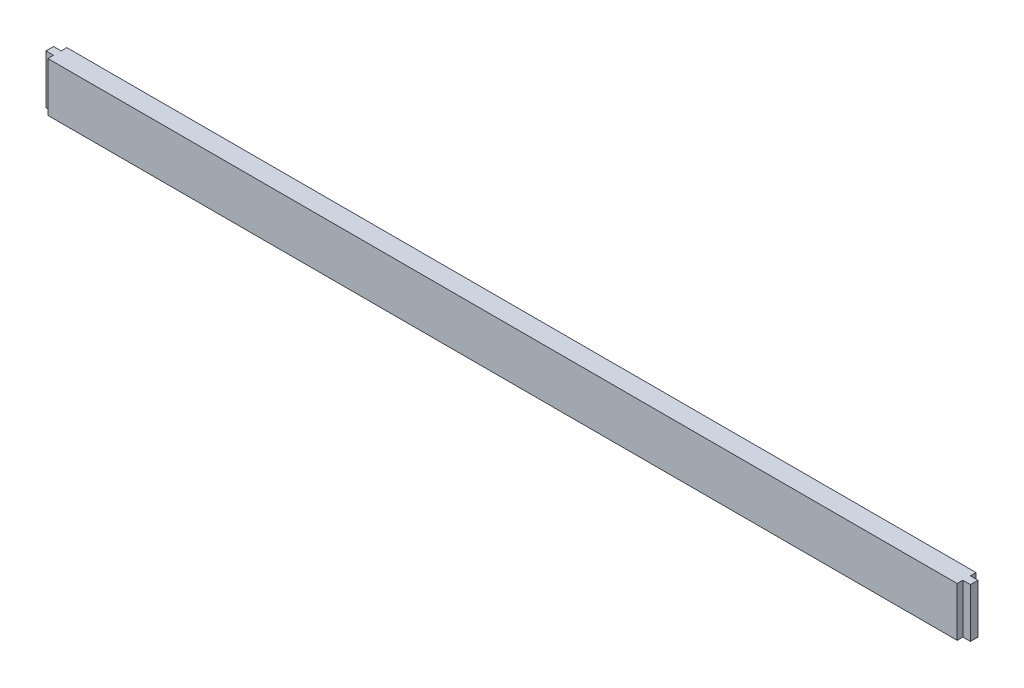
ISO-10303-21;
HEADER;
FILE_DESCRIPTION(('STEP AP214'),'2;1');
FILE_NAME('part.step','',(''),(''),'','','');
FILE_SCHEMA(('AUTOMOTIVE_DESIGN { 1 0 10303 214 1 1 1 1 }'));
ENDSEC;
DATA;
#1=APPLICATION_CONTEXT('core data for automotive mechanical design processes');
#2=APPLICATION_PROTOCOL_DEFINITION('international standard','automotive_design',2000,#1);
#3=PRODUCT_CONTEXT('',#1,'mechanical');
#4=PRODUCT('Part','Part','',(#3));
#5=PRODUCT_RELATED_PRODUCT_CATEGORY('part','',(#4));
#6=PRODUCT_DEFINITION_FORMATION('','',#4);
#7=PRODUCT_DEFINITION_CONTEXT('part definition',#1,'design');
#8=PRODUCT_DEFINITION('design','',#6,#7);
#9=PRODUCT_DEFINITION_SHAPE('','',#8);
#10=(LENGTH_UNIT() NAMED_UNIT(*) SI_UNIT(.MILLI.,.METRE.));
#11=(NAMED_UNIT(*) PLANE_ANGLE_UNIT() SI_UNIT($,.RADIAN.));
#12=(NAMED_UNIT(*) SI_UNIT($,.STERADIAN.) SOLID_ANGLE_UNIT());
#13=UNCERTAINTY_MEASURE_WITH_UNIT(LENGTH_MEASURE(1.E-05),#10,'distance_accuracy_value','');
#14=(GEOMETRIC_REPRESENTATION_CONTEXT(3) GLOBAL_UNCERTAINTY_ASSIGNED_CONTEXT((#13)) GLOBAL_UNIT_ASSIGNED_CONTEXT((#10,
#11,#12)) REPRESENTATION_CONTEXT('',''));
#15=CARTESIAN_POINT('',(0.,0.,0.));
#16=DIRECTION('',(0.,0.,1.));
#17=DIRECTION('',(1.,0.,0.));
#18=AXIS2_PLACEMENT_3D('',#15,#16,#17);
#19=CARTESIAN_POINT('',(0.,0.,15.875));
#20=DIRECTION('',(1.,0.,0.));
#21=DIRECTION('',(0.,0.,-1.));
#22=AXIS2_PLACEMENT_3D('',#19,#20,#21);
#23=PLANE('',#22);
#24=DIRECTION('',(0.,0.,-1.));
#25=VECTOR('',#24,1.);
#26=CARTESIAN_POINT('',(0.,0.,15.875));
#27=LINE('',#26,#25);
#28=CARTESIAN_POINT('',(0.,0.,11.1125));
#29=VERTEX_POINT('',#28);
#30=CARTESIAN_POINT('',(0.,0.,4.7625));
#31=VERTEX_POINT('',#30);
#32=EDGE_CURVE('E11',#29,#31,#27,.T.);
#33=ORIENTED_EDGE('',*,*,#32,.F.);
#34=DIRECTION('',(0.,1.,0.));
#35=VECTOR('',#34,1.);
#36=CARTESIAN_POINT('',(0.,0.,11.1125));
#37=LINE('',#36,#35);
#38=CARTESIAN_POINT('',(0.,41.275,11.1125));
#39=VERTEX_POINT('',#38);
#40=EDGE_CURVE('E125',#29,#39,#37,.T.);
#41=ORIENTED_EDGE('',*,*,#40,.T.);
#42=DIRECTION('',(0.,0.,-1.));
#43=VECTOR('',#42,1.);
#44=CARTESIAN_POINT('',(0.,41.275,15.875));
#45=LINE('',#44,#43);
#46=CARTESIAN_POINT('',(0.,41.275,4.7625));
#47=VERTEX_POINT('',#46);
#48=EDGE_CURVE('E204',#39,#47,#45,.T.);
#49=ORIENTED_EDGE('',*,*,#48,.T.);
#50=DIRECTION('',(0.,1.,0.));
#51=VECTOR('',#50,1.);
#52=CARTESIAN_POINT('',(0.,0.,4.7625));
#53=LINE('',#52,#51);
#54=EDGE_CURVE('E153',#31,#47,#53,.T.);
#55=ORIENTED_EDGE('',*,*,#54,.F.);
#56=EDGE_LOOP('',(#33,#41,#49,#55));
#57=FACE_BOUND('',#56,.T.);
#58=ADVANCED_FACE('F33',(#57),#23,.F.);
#59=CARTESIAN_POINT('',(0.,0.,15.875));
#60=DIRECTION('',(0.,1.,0.));
#61=DIRECTION('',(0.,0.,1.));
#62=AXIS2_PLACEMENT_3D('',#59,#60,#61);
#63=PLANE('',#62);
#64=DIRECTION('',(0.,0.,-1.));
#65=VECTOR('',#64,1.);
#66=CARTESIAN_POINT('',(6.34999999999997,0.,15.875));
#67=LINE('',#66,#65);
#68=CARTESIAN_POINT('',(6.34999999999997,0.,15.875));
#69=VERTEX_POINT('',#68);
#70=CARTESIAN_POINT('',(6.34999999999997,0.,11.1125));
#71=VERTEX_POINT('',#70);
#72=EDGE_CURVE('E47',#69,#71,#67,.T.);
#73=ORIENTED_EDGE('',*,*,#72,.T.);
#74=DIRECTION('',(-1.,0.,0.));
#75=VECTOR('',#74,1.);
#76=CARTESIAN_POINT('',(0.,0.,11.1125));
#77=LINE('',#76,#75);
#78=EDGE_CURVE('E129',#71,#29,#77,.T.);
#79=ORIENTED_EDGE('',*,*,#78,.T.);
#80=ORIENTED_EDGE('',*,*,#32,.T.);
#81=DIRECTION('',(1.,0.,0.));
#82=VECTOR('',#81,1.);
#83=CARTESIAN_POINT('',(0.,0.,4.7625));
#84=LINE('',#83,#82);
#85=CARTESIAN_POINT('',(6.34999999999997,0.,4.7625));
#86=VERTEX_POINT('',#85);
#87=EDGE_CURVE('E147',#31,#86,#84,.T.);
#88=ORIENTED_EDGE('',*,*,#87,.T.);
#89=DIRECTION('',(0.,0.,-1.));
#90=VECTOR('',#89,1.);
#91=CARTESIAN_POINT('',(6.34999999999986,0.,2.67147415300428E-12));
#92=LINE('',#91,#90);
#93=CARTESIAN_POINT('',(6.34999999999986,0.,2.67147415300428E-12));
#94=VERTEX_POINT('',#93);
#95=EDGE_CURVE('E150',#86,#94,#92,.T.);
#96=ORIENTED_EDGE('',*,*,#95,.T.);
#97=DIRECTION('',(1.,0.,0.));
#98=VECTOR('',#97,1.);
#99=CARTESIAN_POINT('',(0.,0.,0.));
#100=LINE('',#99,#98);
#101=CARTESIAN_POINT('',(768.35,0.,0.));
#102=VERTEX_POINT('',#101);
#103=EDGE_CURVE('E195',#94,#102,#100,.T.);
#104=ORIENTED_EDGE('',*,*,#103,.T.);
#105=DIRECTION('',(0.,0.,1.));
#106=VECTOR('',#105,1.);
#107=CARTESIAN_POINT('',(768.35,0.,0.));
#108=LINE('',#107,#106);
#109=CARTESIAN_POINT('',(768.35,0.,4.7625));
#110=VERTEX_POINT('',#109);
#111=EDGE_CURVE('E164',#102,#110,#108,.T.);
#112=ORIENTED_EDGE('',*,*,#111,.T.);
#113=DIRECTION('',(1.,0.,0.));
#114=VECTOR('',#113,1.);
#115=CARTESIAN_POINT('',(774.7,0.,4.7625));
#116=LINE('',#115,#114);
#117=CARTESIAN_POINT('',(774.7,0.,4.7625));
#118=VERTEX_POINT('',#117);
#119=EDGE_CURVE('E167',#110,#118,#116,.T.);
#120=ORIENTED_EDGE('',*,*,#119,.T.);
#121=DIRECTION('',(0.,0.,-1.));
#122=VECTOR('',#121,1.);
#123=CARTESIAN_POINT('',(774.7,0.,15.875));
#124=LINE('',#123,#122);
#125=CARTESIAN_POINT('',(774.7,0.,11.1125));
#126=VERTEX_POINT('',#125);
#127=EDGE_CURVE('E40',#126,#118,#124,.T.);
#128=ORIENTED_EDGE('',*,*,#127,.F.);
#129=DIRECTION('',(-1.,0.,0.));
#130=VECTOR('',#129,1.);
#131=CARTESIAN_POINT('',(774.7,0.,11.1125));
#132=LINE('',#131,#130);
#133=CARTESIAN_POINT('',(768.35,0.,11.1125));
#134=VERTEX_POINT('',#133);
#135=EDGE_CURVE('E182',#126,#134,#132,.T.);
#136=ORIENTED_EDGE('',*,*,#135,.T.);
#137=DIRECTION('',(0.,0.,1.));
#138=VECTOR('',#137,1.);
#139=CARTESIAN_POINT('',(768.35,0.,15.875));
#140=LINE('',#139,#138);
#141=CARTESIAN_POINT('',(768.35,0.,15.875));
#142=VERTEX_POINT('',#141);
#143=EDGE_CURVE('E185',#134,#142,#140,.T.);
#144=ORIENTED_EDGE('',*,*,#143,.T.);
#145=DIRECTION('',(1.,0.,0.));
#146=VECTOR('',#145,1.);
#147=CARTESIAN_POINT('',(0.,0.,15.875));
#148=LINE('',#147,#146);
#149=EDGE_CURVE('E138',#69,#142,#148,.T.);
#150=ORIENTED_EDGE('',*,*,#149,.F.);
#151=EDGE_LOOP('',(#73,#79,#80,#88,#96,#104,#112,#120,#128,#136,#144,#150));
#152=FACE_BOUND('',#151,.T.);
#153=ADVANCED_FACE('F136',(#152),#63,.F.);
#154=CARTESIAN_POINT('',(774.7,0.,15.875));
#155=DIRECTION('',(-1.,0.,0.));
#156=DIRECTION('',(0.,0.,1.));
#157=AXIS2_PLACEMENT_3D('',#154,#155,#156);
#158=PLANE('',#157);
#159=ORIENTED_EDGE('',*,*,#127,.T.);
#160=DIRECTION('',(0.,1.,0.));
#161=VECTOR('',#160,1.);
#162=CARTESIAN_POINT('',(774.7,0.,4.7625));
#163=LINE('',#162,#161);
#164=CARTESIAN_POINT('',(774.7,41.275,4.7625));
#165=VERTEX_POINT('',#164);
#166=EDGE_CURVE('E175',#118,#165,#163,.T.);
#167=ORIENTED_EDGE('',*,*,#166,.T.);
#168=DIRECTION('',(0.,0.,-1.));
#169=VECTOR('',#168,1.);
#170=CARTESIAN_POINT('',(774.7,41.275,15.875));
#171=LINE('',#170,#169);
#172=CARTESIAN_POINT('',(774.7,41.275,11.1125));
#173=VERTEX_POINT('',#172);
#174=EDGE_CURVE('E209',#173,#165,#171,.T.);
#175=ORIENTED_EDGE('',*,*,#174,.F.);
#176=DIRECTION('',(0.,1.,0.));
#177=VECTOR('',#176,1.);
#178=CARTESIAN_POINT('',(774.7,0.,11.1125));
#179=LINE('',#178,#177);
#180=EDGE_CURVE('E188',#126,#173,#179,.T.);
#181=ORIENTED_EDGE('',*,*,#180,.F.);
#182=EDGE_LOOP('',(#159,#167,#175,#181));
#183=FACE_BOUND('',#182,.T.);
#184=ADVANCED_FACE('F215',(#183),#158,.F.);
#185=CARTESIAN_POINT('',(0.,41.275,15.875));
#186=DIRECTION('',(0.,-1.,0.));
#187=DIRECTION('',(0.,0.,-1.));
#188=AXIS2_PLACEMENT_3D('',#185,#186,#187);
#189=PLANE('',#188);
#190=ORIENTED_EDGE('',*,*,#48,.F.);
#191=DIRECTION('',(-1.,0.,0.));
#192=VECTOR('',#191,1.);
#193=CARTESIAN_POINT('',(0.,41.275,11.1125));
#194=LINE('',#193,#192);
#195=CARTESIAN_POINT('',(6.34999999999997,41.275,11.1125));
#196=VERTEX_POINT('',#195);
#197=EDGE_CURVE('E139',#196,#39,#194,.T.);
#198=ORIENTED_EDGE('',*,*,#197,.F.);
#199=DIRECTION('',(0.,0.,-1.));
#200=VECTOR('',#199,1.);
#201=CARTESIAN_POINT('',(6.34999999999997,41.275,15.875));
#202=LINE('',#201,#200);
#203=CARTESIAN_POINT('',(6.34999999999997,41.275,15.875));
#204=VERTEX_POINT('',#203);
#205=EDGE_CURVE('E122',#204,#196,#202,.T.);
#206=ORIENTED_EDGE('',*,*,#205,.F.);
#207=DIRECTION('',(-1.,0.,0.));
#208=VECTOR('',#207,1.);
#209=CARTESIAN_POINT('',(0.,41.275,15.875));
#210=LINE('',#209,#208);
#211=CARTESIAN_POINT('',(768.35,41.275,15.875));
#212=VERTEX_POINT('',#211);
#213=EDGE_CURVE('E200',#212,#204,#210,.T.);
#214=ORIENTED_EDGE('',*,*,#213,.F.);
#215=DIRECTION('',(0.,0.,1.));
#216=VECTOR('',#215,1.);
#217=CARTESIAN_POINT('',(768.35,41.275,15.875));
#218=LINE('',#217,#216);
#219=CARTESIAN_POINT('',(768.35,41.275,11.1125));
#220=VERTEX_POINT('',#219);
#221=EDGE_CURVE('E186',#220,#212,#218,.T.);
#222=ORIENTED_EDGE('',*,*,#221,.F.);
#223=DIRECTION('',(-1.,0.,0.));
#224=VECTOR('',#223,1.);
#225=CARTESIAN_POINT('',(774.7,41.275,11.1125));
#226=LINE('',#225,#224);
#227=EDGE_CURVE('E178',#173,#220,#226,.T.);
#228=ORIENTED_EDGE('',*,*,#227,.F.);
#229=ORIENTED_EDGE('',*,*,#174,.T.);
#230=DIRECTION('',(1.,0.,0.));
#231=VECTOR('',#230,1.);
#232=CARTESIAN_POINT('',(774.7,41.275,4.7625));
#233=LINE('',#232,#231);
#234=CARTESIAN_POINT('',(768.35,41.275,4.7625));
#235=VERTEX_POINT('',#234);
#236=EDGE_CURVE('E168',#235,#165,#233,.T.);
#237=ORIENTED_EDGE('',*,*,#236,.F.);
#238=DIRECTION('',(0.,0.,1.));
#239=VECTOR('',#238,1.);
#240=CARTESIAN_POINT('',(768.35,41.275,0.));
#241=LINE('',#240,#239);
#242=CARTESIAN_POINT('',(768.35,41.275,0.));
#243=VERTEX_POINT('',#242);
#244=EDGE_CURVE('E159',#243,#235,#241,.T.);
#245=ORIENTED_EDGE('',*,*,#244,.F.);
#246=DIRECTION('',(-1.,0.,0.));
#247=VECTOR('',#246,1.);
#248=CARTESIAN_POINT('',(0.,41.275,0.));
#249=LINE('',#248,#247);
#250=CARTESIAN_POINT('',(6.34999999999997,41.275,0.));
#251=VERTEX_POINT('',#250);
#252=EDGE_CURVE('E201',#243,#251,#249,.T.);
#253=ORIENTED_EDGE('',*,*,#252,.T.);
#254=DIRECTION('',(0.,0.,-1.));
#255=VECTOR('',#254,1.);
#256=CARTESIAN_POINT('',(6.34999999999986,41.275,2.67147415300428E-12));
#257=LINE('',#256,#255);
#258=CARTESIAN_POINT('',(6.34999999999997,41.275,4.7625));
#259=VERTEX_POINT('',#258);
#260=EDGE_CURVE('E55',#259,#251,#257,.T.);
#261=ORIENTED_EDGE('',*,*,#260,.F.);
#262=DIRECTION('',(1.,0.,0.));
#263=VECTOR('',#262,1.);
#264=CARTESIAN_POINT('',(0.,41.275,4.7625));
#265=LINE('',#264,#263);
#266=EDGE_CURVE('E144',#47,#259,#265,.T.);
#267=ORIENTED_EDGE('',*,*,#266,.F.);
#268=EDGE_LOOP('',(#190,#198,#206,#214,#222,#228,#229,#237,#245,#253,#261,#267));
#269=FACE_BOUND('',#268,.T.);
#270=ADVANCED_FACE('F225',(#269),#189,.F.);
#271=CARTESIAN_POINT('',(0.,0.,15.875));
#272=DIRECTION('',(0.,0.,-1.));
#273=DIRECTION('',(-1.,0.,0.));
#274=AXIS2_PLACEMENT_3D('',#271,#272,#273);
#275=PLANE('',#274);
#276=ORIENTED_EDGE('',*,*,#213,.T.);
#277=DIRECTION('',(0.,1.,0.));
#278=VECTOR('',#277,1.);
#279=CARTESIAN_POINT('',(6.34999999999997,0.,15.875));
#280=LINE('',#279,#278);
#281=EDGE_CURVE('E126',#69,#204,#280,.T.);
#282=ORIENTED_EDGE('',*,*,#281,.F.);
#283=ORIENTED_EDGE('',*,*,#149,.T.);
#284=DIRECTION('',(0.,1.,0.));
#285=VECTOR('',#284,1.);
#286=CARTESIAN_POINT('',(768.35,0.,15.875));
#287=LINE('',#286,#285);
#288=EDGE_CURVE('E192',#142,#212,#287,.T.);
#289=ORIENTED_EDGE('',*,*,#288,.T.);
#290=EDGE_LOOP('',(#276,#282,#283,#289));
#291=FACE_BOUND('',#290,.T.);
#292=ADVANCED_FACE('F237',(#291),#275,.F.);
#293=CARTESIAN_POINT('',(0.,0.,0.));
#294=DIRECTION('',(0.,0.,-1.));
#295=DIRECTION('',(-1.,0.,0.));
#296=AXIS2_PLACEMENT_3D('',#293,#294,#295);
#297=PLANE('',#296);
#298=DIRECTION('',(0.,1.,0.));
#299=VECTOR('',#298,1.);
#300=CARTESIAN_POINT('',(6.34999999999986,0.,2.67147415300428E-12));
#301=LINE('',#300,#299);
#302=EDGE_CURVE('E157',#94,#251,#301,.T.);
#303=ORIENTED_EDGE('',*,*,#302,.T.);
#304=ORIENTED_EDGE('',*,*,#252,.F.);
#305=DIRECTION('',(0.,1.,0.));
#306=VECTOR('',#305,1.);
#307=CARTESIAN_POINT('',(768.35,0.,0.));
#308=LINE('',#307,#306);
#309=EDGE_CURVE('E171',#102,#243,#308,.T.);
#310=ORIENTED_EDGE('',*,*,#309,.F.);
#311=ORIENTED_EDGE('',*,*,#103,.F.);
#312=EDGE_LOOP('',(#303,#304,#310,#311));
#313=FACE_BOUND('',#312,.T.);
#314=ADVANCED_FACE('F249',(#313),#297,.T.);
#315=CARTESIAN_POINT('',(768.35,0.,15.875));
#316=DIRECTION('',(-1.,0.,0.));
#317=DIRECTION('',(0.,0.,1.));
#318=AXIS2_PLACEMENT_3D('',#315,#316,#317);
#319=PLANE('',#318);
#320=ORIENTED_EDGE('',*,*,#221,.T.);
#321=ORIENTED_EDGE('',*,*,#288,.F.);
#322=ORIENTED_EDGE('',*,*,#143,.F.);
#323=DIRECTION('',(0.,1.,0.));
#324=VECTOR('',#323,1.);
#325=CARTESIAN_POINT('',(768.35,0.,11.1125));
#326=LINE('',#325,#324);
#327=EDGE_CURVE('E196',#134,#220,#326,.T.);
#328=ORIENTED_EDGE('',*,*,#327,.T.);
#329=EDGE_LOOP('',(#320,#321,#322,#328));
#330=FACE_BOUND('',#329,.T.);
#331=ADVANCED_FACE('F235',(#330),#319,.F.);
#332=CARTESIAN_POINT('',(774.7,0.,11.1125));
#333=DIRECTION('',(0.,0.,-1.));
#334=DIRECTION('',(-1.,0.,0.));
#335=AXIS2_PLACEMENT_3D('',#332,#333,#334);
#336=PLANE('',#335);
#337=ORIENTED_EDGE('',*,*,#227,.T.);
#338=ORIENTED_EDGE('',*,*,#327,.F.);
#339=ORIENTED_EDGE('',*,*,#135,.F.);
#340=ORIENTED_EDGE('',*,*,#180,.T.);
#341=EDGE_LOOP('',(#337,#338,#339,#340));
#342=FACE_BOUND('',#341,.T.);
#343=ADVANCED_FACE('F231',(#342),#336,.F.);
#344=CARTESIAN_POINT('',(774.7,0.,4.7625));
#345=DIRECTION('',(0.,0.,1.));
#346=DIRECTION('',(1.,0.,0.));
#347=AXIS2_PLACEMENT_3D('',#344,#345,#346);
#348=PLANE('',#347);
#349=ORIENTED_EDGE('',*,*,#236,.T.);
#350=ORIENTED_EDGE('',*,*,#166,.F.);
#351=ORIENTED_EDGE('',*,*,#119,.F.);
#352=DIRECTION('',(0.,1.,0.));
#353=VECTOR('',#352,1.);
#354=CARTESIAN_POINT('',(768.35,0.,4.7625));
#355=LINE('',#354,#353);
#356=EDGE_CURVE('E179',#110,#235,#355,.T.);
#357=ORIENTED_EDGE('',*,*,#356,.T.);
#358=EDGE_LOOP('',(#349,#350,#351,#357));
#359=FACE_BOUND('',#358,.T.);
#360=ADVANCED_FACE('F220',(#359),#348,.F.);
#361=CARTESIAN_POINT('',(768.35,0.,0.));
#362=DIRECTION('',(-1.,0.,0.));
#363=DIRECTION('',(0.,0.,1.));
#364=AXIS2_PLACEMENT_3D('',#361,#362,#363);
#365=PLANE('',#364);
#366=ORIENTED_EDGE('',*,*,#244,.T.);
#367=ORIENTED_EDGE('',*,*,#356,.F.);
#368=ORIENTED_EDGE('',*,*,#111,.F.);
#369=ORIENTED_EDGE('',*,*,#309,.T.);
#370=EDGE_LOOP('',(#366,#367,#368,#369));
#371=FACE_BOUND('',#370,.T.);
#372=ADVANCED_FACE('F251',(#371),#365,.F.);
#373=CARTESIAN_POINT('',(6.34999999999986,0.,2.67147415300428E-12));
#374=DIRECTION('',(1.,0.,0.));
#375=DIRECTION('',(0.,0.,-1.));
#376=AXIS2_PLACEMENT_3D('',#373,#374,#375);
#377=PLANE('',#376);
#378=ORIENTED_EDGE('',*,*,#260,.T.);
#379=ORIENTED_EDGE('',*,*,#302,.F.);
#380=ORIENTED_EDGE('',*,*,#95,.F.);
#381=DIRECTION('',(0.,1.,0.));
#382=VECTOR('',#381,1.);
#383=CARTESIAN_POINT('',(6.34999999999997,0.,4.7625));
#384=LINE('',#383,#382);
#385=EDGE_CURVE('E160',#86,#259,#384,.T.);
#386=ORIENTED_EDGE('',*,*,#385,.T.);
#387=EDGE_LOOP('',(#378,#379,#380,#386));
#388=FACE_BOUND('',#387,.T.);
#389=ADVANCED_FACE('F245',(#388),#377,.F.);
#390=CARTESIAN_POINT('',(0.,0.,4.7625));
#391=DIRECTION('',(0.,0.,1.));
#392=DIRECTION('',(1.,0.,0.));
#393=AXIS2_PLACEMENT_3D('',#390,#391,#392);
#394=PLANE('',#393);
#395=ORIENTED_EDGE('',*,*,#266,.T.);
#396=ORIENTED_EDGE('',*,*,#385,.F.);
#397=ORIENTED_EDGE('',*,*,#87,.F.);
#398=ORIENTED_EDGE('',*,*,#54,.T.);
#399=EDGE_LOOP('',(#395,#396,#397,#398));
#400=FACE_BOUND('',#399,.T.);
#401=ADVANCED_FACE('F243',(#400),#394,.F.);
#402=CARTESIAN_POINT('',(0.,0.,11.1125));
#403=DIRECTION('',(0.,0.,-1.));
#404=DIRECTION('',(-1.,0.,0.));
#405=AXIS2_PLACEMENT_3D('',#402,#403,#404);
#406=PLANE('',#405);
#407=ORIENTED_EDGE('',*,*,#197,.T.);
#408=ORIENTED_EDGE('',*,*,#40,.F.);
#409=ORIENTED_EDGE('',*,*,#78,.F.);
#410=DIRECTION('',(0.,1.,0.));
#411=VECTOR('',#410,1.);
#412=CARTESIAN_POINT('',(6.34999999999997,0.,11.1125));
#413=LINE('',#412,#411);
#414=EDGE_CURVE('E118',#71,#196,#413,.T.);
#415=ORIENTED_EDGE('',*,*,#414,.T.);
#416=EDGE_LOOP('',(#407,#408,#409,#415));
#417=FACE_BOUND('',#416,.T.);
#418=ADVANCED_FACE('F130',(#417),#406,.F.);
#419=CARTESIAN_POINT('',(6.34999999999997,0.,15.875));
#420=DIRECTION('',(1.,0.,0.));
#421=DIRECTION('',(0.,0.,-1.));
#422=AXIS2_PLACEMENT_3D('',#419,#420,#421);
#423=PLANE('',#422);
#424=ORIENTED_EDGE('',*,*,#205,.T.);
#425=ORIENTED_EDGE('',*,*,#414,.F.);
#426=ORIENTED_EDGE('',*,*,#72,.F.);
#427=ORIENTED_EDGE('',*,*,#281,.T.);
#428=EDGE_LOOP('',(#424,#425,#426,#427));
#429=FACE_BOUND('',#428,.T.);
#430=ADVANCED_FACE('F120',(#429),#423,.F.);
#431=CLOSED_SHELL('',(#58,#153,#184,#270,#292,#314,#331,#343,#360,#372,#389,#401,#418,#430));
#432=MANIFOLD_SOLID_BREP('B2',#431);
#433=ADVANCED_BREP_SHAPE_REPRESENTATION('',(#18,#432),#14);
#434=SHAPE_DEFINITION_REPRESENTATION(#9,#433);
ENDSEC;
END-ISO-10303-21;
